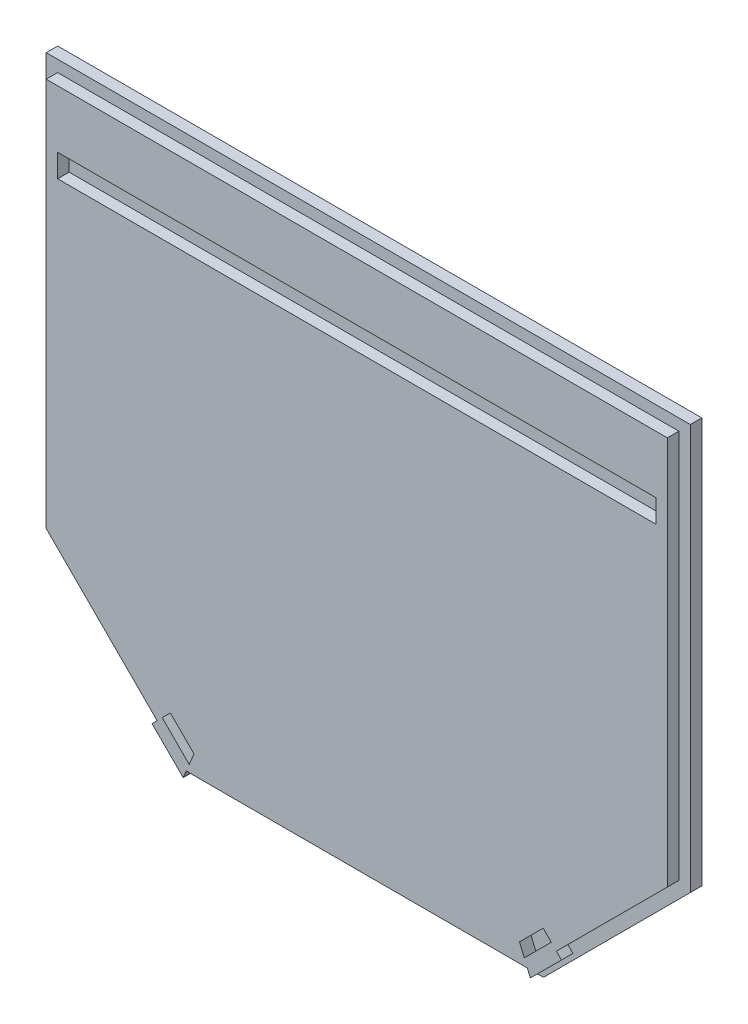
ISO-10303-21;
HEADER;
FILE_DESCRIPTION(('STEP AP214'),'2;1');
FILE_NAME('part.step','',(''),(''),'','','');
FILE_SCHEMA(('AUTOMOTIVE_DESIGN { 1 0 10303 214 1 1 1 1 }'));
ENDSEC;
DATA;
#1=APPLICATION_CONTEXT('core data for automotive mechanical design processes');
#2=APPLICATION_PROTOCOL_DEFINITION('international standard','automotive_design',2000,#1);
#3=PRODUCT_CONTEXT('',#1,'mechanical');
#4=PRODUCT('Part','Part','',(#3));
#5=PRODUCT_RELATED_PRODUCT_CATEGORY('part','',(#4));
#6=PRODUCT_DEFINITION_FORMATION('','',#4);
#7=PRODUCT_DEFINITION_CONTEXT('part definition',#1,'design');
#8=PRODUCT_DEFINITION('design','',#6,#7);
#9=PRODUCT_DEFINITION_SHAPE('','',#8);
#10=(LENGTH_UNIT() NAMED_UNIT(*) SI_UNIT(.MILLI.,.METRE.));
#11=(NAMED_UNIT(*) PLANE_ANGLE_UNIT() SI_UNIT($,.RADIAN.));
#12=(NAMED_UNIT(*) SI_UNIT($,.STERADIAN.) SOLID_ANGLE_UNIT());
#13=UNCERTAINTY_MEASURE_WITH_UNIT(LENGTH_MEASURE(1.E-05),#10,'distance_accuracy_value','');
#14=(GEOMETRIC_REPRESENTATION_CONTEXT(3) GLOBAL_UNCERTAINTY_ASSIGNED_CONTEXT((#13)) GLOBAL_UNIT_ASSIGNED_CONTEXT((#10,
#11,#12)) REPRESENTATION_CONTEXT('',''));
#15=CARTESIAN_POINT('',(0.,0.,0.));
#16=DIRECTION('',(0.,0.,1.));
#17=DIRECTION('',(1.,0.,0.));
#18=AXIS2_PLACEMENT_3D('',#15,#16,#17);
#19=CARTESIAN_POINT('',(0.,0.,12.7));
#20=DIRECTION('',(1.,0.,0.));
#21=DIRECTION('',(0.,1.,0.));
#22=AXIS2_PLACEMENT_3D('',#19,#20,#21);
#23=PLANE('',#22);
#24=DIRECTION('',(0.,-1.,0.));
#25=VECTOR('',#24,1.);
#26=CARTESIAN_POINT('',(0.,0.,6.35));
#27=LINE('',#26,#25);
#28=CARTESIAN_POINT('',(0.,0.,6.35));
#29=VERTEX_POINT('',#28);
#30=CARTESIAN_POINT('',(0.,-223.774000000001,6.35));
#31=VERTEX_POINT('',#30);
#32=EDGE_CURVE('E359',#29,#31,#27,.T.);
#33=ORIENTED_EDGE('',*,*,#32,.F.);
#34=DIRECTION('',(0.,0.,-1.));
#35=VECTOR('',#34,1.);
#36=CARTESIAN_POINT('',(0.,0.,12.7));
#37=LINE('',#36,#35);
#38=CARTESIAN_POINT('',(0.,0.,0.));
#39=VERTEX_POINT('',#38);
#40=EDGE_CURVE('E478',#29,#39,#37,.T.);
#41=ORIENTED_EDGE('',*,*,#40,.T.);
#42=DIRECTION('',(0.,-1.,0.));
#43=VECTOR('',#42,1.);
#44=CARTESIAN_POINT('',(0.,0.,0.));
#45=LINE('',#44,#43);
#46=CARTESIAN_POINT('',(0.,-223.774000000001,0.));
#47=VERTEX_POINT('',#46);
#48=EDGE_CURVE('E454',#39,#47,#45,.T.);
#49=ORIENTED_EDGE('',*,*,#48,.T.);
#50=DIRECTION('',(0.,0.,-1.));
#51=VECTOR('',#50,1.);
#52=CARTESIAN_POINT('',(0.,-223.774000000001,12.7));
#53=LINE('',#52,#51);
#54=EDGE_CURVE('E12',#31,#47,#53,.T.);
#55=ORIENTED_EDGE('',*,*,#54,.F.);
#56=EDGE_LOOP('',(#33,#41,#49,#55));
#57=FACE_BOUND('',#56,.T.);
#58=ADVANCED_FACE('F64',(#57),#23,.F.);
#59=CARTESIAN_POINT('',(81.026,-304.8,12.7));
#60=DIRECTION('',(0.707106781186543,0.707106781186552,0.));
#61=DIRECTION('',(-0.707106781186552,0.707106781186543,0.));
#62=AXIS2_PLACEMENT_3D('',#59,#60,#61);
#63=PLANE('',#62);
#64=DIRECTION('',(0.707106781186551,-0.707106781186544,0.));
#65=VECTOR('',#64,1.);
#66=CARTESIAN_POINT('',(-111.887,-111.887000000002,6.35));
#67=LINE('',#66,#65);
#68=CARTESIAN_POINT('',(81.026,-304.8,6.35));
#69=VERTEX_POINT('',#68);
#70=EDGE_CURVE('E361',#31,#69,#67,.T.);
#71=ORIENTED_EDGE('',*,*,#70,.F.);
#72=ORIENTED_EDGE('',*,*,#54,.T.);
#73=DIRECTION('',(0.707106781186552,-0.707106781186543,0.));
#74=VECTOR('',#73,1.);
#75=CARTESIAN_POINT('',(81.026,-304.8,0.));
#76=LINE('',#75,#74);
#77=CARTESIAN_POINT('',(81.026,-304.8,0.));
#78=VERTEX_POINT('',#77);
#79=EDGE_CURVE('E463',#47,#78,#76,.T.);
#80=ORIENTED_EDGE('',*,*,#79,.T.);
#81=DIRECTION('',(0.,0.,-1.));
#82=VECTOR('',#81,1.);
#83=CARTESIAN_POINT('',(81.026,-304.8,12.7));
#84=LINE('',#83,#82);
#85=EDGE_CURVE('E71',#69,#78,#84,.T.);
#86=ORIENTED_EDGE('',*,*,#85,.F.);
#87=EDGE_LOOP('',(#71,#72,#80,#86));
#88=FACE_BOUND('',#87,.T.);
#89=ADVANCED_FACE('F494',(#88),#63,.F.);
#90=CARTESIAN_POINT('',(81.026,-304.8,12.7));
#91=DIRECTION('',(0.,1.,0.));
#92=DIRECTION('',(0.,0.,1.));
#93=AXIS2_PLACEMENT_3D('',#90,#91,#92);
#94=PLANE('',#93);
#95=DIRECTION('',(1.,0.,0.));
#96=VECTOR('',#95,1.);
#97=CARTESIAN_POINT('',(0.,-304.8,6.35));
#98=LINE('',#97,#96);
#99=CARTESIAN_POINT('',(274.574,-304.8,6.35));
#100=VERTEX_POINT('',#99);
#101=EDGE_CURVE('E363',#69,#100,#98,.T.);
#102=ORIENTED_EDGE('',*,*,#101,.F.);
#103=ORIENTED_EDGE('',*,*,#85,.T.);
#104=DIRECTION('',(1.,0.,0.));
#105=VECTOR('',#104,1.);
#106=CARTESIAN_POINT('',(81.026,-304.8,0.));
#107=LINE('',#106,#105);
#108=CARTESIAN_POINT('',(274.574,-304.8,0.));
#109=VERTEX_POINT('',#108);
#110=EDGE_CURVE('E466',#78,#109,#107,.T.);
#111=ORIENTED_EDGE('',*,*,#110,.T.);
#112=DIRECTION('',(0.,0.,-1.));
#113=VECTOR('',#112,1.);
#114=CARTESIAN_POINT('',(274.574,-304.8,12.7));
#115=LINE('',#114,#113);
#116=EDGE_CURVE('E484',#100,#109,#115,.T.);
#117=ORIENTED_EDGE('',*,*,#116,.F.);
#118=EDGE_LOOP('',(#102,#103,#111,#117));
#119=FACE_BOUND('',#118,.T.);
#120=ADVANCED_FACE('F488',(#119),#94,.F.);
#121=CARTESIAN_POINT('',(292.534512242138,-286.839487757862,12.7));
#122=DIRECTION('',(-0.707106781186544,0.707106781186551,0.));
#123=DIRECTION('',(-0.707106781186551,-0.707106781186544,0.));
#124=AXIS2_PLACEMENT_3D('',#121,#122,#123);
#125=PLANE('',#124);
#126=DIRECTION('',(0.707106781186552,0.707106781186543,0.));
#127=VECTOR('',#126,1.);
#128=CARTESIAN_POINT('',(289.686999999998,-289.687000000002,6.35));
#129=LINE('',#128,#127);
#130=CARTESIAN_POINT('',(355.6,-223.774000000001,6.35));
#131=VERTEX_POINT('',#130);
#132=EDGE_CURVE('E365',#100,#131,#129,.T.);
#133=ORIENTED_EDGE('',*,*,#132,.F.);
#134=ORIENTED_EDGE('',*,*,#116,.T.);
#135=DIRECTION('',(0.707106781186551,0.707106781186544,0.));
#136=VECTOR('',#135,1.);
#137=CARTESIAN_POINT('',(292.534512242138,-286.839487757862,0.));
#138=LINE('',#137,#136);
#139=CARTESIAN_POINT('',(355.6,-223.774000000001,0.));
#140=VERTEX_POINT('',#139);
#141=EDGE_CURVE('E469',#109,#140,#138,.T.);
#142=ORIENTED_EDGE('',*,*,#141,.T.);
#143=DIRECTION('',(0.,0.,-1.));
#144=VECTOR('',#143,1.);
#145=CARTESIAN_POINT('',(355.6,-223.774000000001,12.7));
#146=LINE('',#145,#144);
#147=EDGE_CURVE('E482',#131,#140,#146,.T.);
#148=ORIENTED_EDGE('',*,*,#147,.F.);
#149=EDGE_LOOP('',(#133,#134,#142,#148));
#150=FACE_BOUND('',#149,.T.);
#151=ADVANCED_FACE('F505',(#150),#125,.F.);
#152=CARTESIAN_POINT('',(355.6,-223.774000000001,12.7));
#153=DIRECTION('',(-1.,0.,0.));
#154=DIRECTION('',(0.,0.,1.));
#155=AXIS2_PLACEMENT_3D('',#152,#153,#154);
#156=PLANE('',#155);
#157=DIRECTION('',(0.,1.,0.));
#158=VECTOR('',#157,1.);
#159=CARTESIAN_POINT('',(355.6,0.,6.35));
#160=LINE('',#159,#158);
#161=CARTESIAN_POINT('',(355.6,0.,6.35));
#162=VERTEX_POINT('',#161);
#163=EDGE_CURVE('E367',#131,#162,#160,.T.);
#164=ORIENTED_EDGE('',*,*,#163,.F.);
#165=ORIENTED_EDGE('',*,*,#147,.T.);
#166=DIRECTION('',(0.,1.,0.));
#167=VECTOR('',#166,1.);
#168=CARTESIAN_POINT('',(355.6,-223.774000000001,0.));
#169=LINE('',#168,#167);
#170=CARTESIAN_POINT('',(355.6,0.,0.));
#171=VERTEX_POINT('',#170);
#172=EDGE_CURVE('E472',#140,#171,#169,.T.);
#173=ORIENTED_EDGE('',*,*,#172,.T.);
#174=DIRECTION('',(0.,0.,-1.));
#175=VECTOR('',#174,1.);
#176=CARTESIAN_POINT('',(355.6,0.,12.7));
#177=LINE('',#176,#175);
#178=EDGE_CURVE('E480',#162,#171,#177,.T.);
#179=ORIENTED_EDGE('',*,*,#178,.F.);
#180=EDGE_LOOP('',(#164,#165,#173,#179));
#181=FACE_BOUND('',#180,.T.);
#182=ADVANCED_FACE('F512',(#181),#156,.F.);
#183=CARTESIAN_POINT('',(0.,0.,12.7));
#184=DIRECTION('',(0.,-1.,0.));
#185=DIRECTION('',(0.,0.,-1.));
#186=AXIS2_PLACEMENT_3D('',#183,#184,#185);
#187=PLANE('',#186);
#188=DIRECTION('',(-1.,0.,0.));
#189=VECTOR('',#188,1.);
#190=CARTESIAN_POINT('',(0.,0.,6.35));
#191=LINE('',#190,#189);
#192=EDGE_CURVE('E357',#162,#29,#191,.T.);
#193=ORIENTED_EDGE('',*,*,#192,.F.);
#194=ORIENTED_EDGE('',*,*,#178,.T.);
#195=DIRECTION('',(-1.,0.,0.));
#196=VECTOR('',#195,1.);
#197=CARTESIAN_POINT('',(0.,0.,0.));
#198=LINE('',#197,#196);
#199=EDGE_CURVE('E475',#171,#39,#198,.T.);
#200=ORIENTED_EDGE('',*,*,#199,.T.);
#201=ORIENTED_EDGE('',*,*,#40,.F.);
#202=EDGE_LOOP('',(#193,#194,#200,#201));
#203=FACE_BOUND('',#202,.T.);
#204=ADVANCED_FACE('F514',(#203),#187,.F.);
#205=CARTESIAN_POINT('',(0.,0.,0.));
#206=DIRECTION('',(0.,0.,1.));
#207=DIRECTION('',(1.,0.,0.));
#208=AXIS2_PLACEMENT_3D('',#205,#206,#207);
#209=PLANE('',#208);
#210=ORIENTED_EDGE('',*,*,#48,.F.);
#211=ORIENTED_EDGE('',*,*,#199,.F.);
#212=ORIENTED_EDGE('',*,*,#172,.F.);
#213=ORIENTED_EDGE('',*,*,#141,.F.);
#214=ORIENTED_EDGE('',*,*,#110,.F.);
#215=ORIENTED_EDGE('',*,*,#79,.F.);
#216=EDGE_LOOP('',(#210,#211,#212,#213,#214,#215));
#217=FACE_BOUND('',#216,.T.);
#218=ADVANCED_FACE('F499',(#217),#209,.F.);
#219=CARTESIAN_POINT('',(2.79565736456703,2.79565736456703,6.35));
#220=DIRECTION('',(0.707106781186548,0.707106781186548,0.));
#221=DIRECTION('',(-0.707106781186548,0.707106781186548,0.));
#222=AXIS2_PLACEMENT_3D('',#219,#220,#221);
#223=PLANE('',#222);
#224=DIRECTION('',(-0.707106781186548,0.707106781186548,0.));
#225=VECTOR('',#224,1.);
#226=CARTESIAN_POINT('',(2.79565736456703,2.79565736456703,12.7));
#227=LINE('',#226,#225);
#228=CARTESIAN_POINT('',(290.812329726048,-285.221014996914,12.7));
#229=VERTEX_POINT('',#228);
#230=CARTESIAN_POINT('',(287.992529304033,-282.401214574899,12.7));
#231=VERTEX_POINT('',#230);
#232=EDGE_CURVE('E295',#229,#231,#227,.T.);
#233=ORIENTED_EDGE('',*,*,#232,.F.);
#234=DIRECTION('',(0.,0.,1.));
#235=VECTOR('',#234,1.);
#236=CARTESIAN_POINT('',(290.812329726048,-285.221014996914,6.35));
#237=LINE('',#236,#235);
#238=CARTESIAN_POINT('',(290.812329726048,-285.221014996914,6.35));
#239=VERTEX_POINT('',#238);
#240=EDGE_CURVE('E369',#239,#229,#237,.T.);
#241=ORIENTED_EDGE('',*,*,#240,.F.);
#242=DIRECTION('',(-0.707106781186548,0.707106781186548,0.));
#243=VECTOR('',#242,1.);
#244=CARTESIAN_POINT('',(2.79565736456703,2.79565736456703,6.35));
#245=LINE('',#244,#243);
#246=CARTESIAN_POINT('',(287.992529304033,-282.401214574899,6.35));
#247=VERTEX_POINT('',#246);
#248=EDGE_CURVE('E328',#239,#247,#245,.T.);
#249=ORIENTED_EDGE('',*,*,#248,.T.);
#250=DIRECTION('',(0.,0.,1.));
#251=VECTOR('',#250,1.);
#252=CARTESIAN_POINT('',(287.992529304033,-282.401214574899,6.35));
#253=LINE('',#252,#251);
#254=EDGE_CURVE('E404',#247,#231,#253,.T.);
#255=ORIENTED_EDGE('',*,*,#254,.T.);
#256=EDGE_LOOP('',(#233,#241,#249,#255));
#257=FACE_BOUND('',#256,.T.);
#258=ADVANCED_FACE('F536',(#257),#223,.T.);
#259=CARTESIAN_POINT('',(285.196871939467,-285.196871939465,6.35));
#260=DIRECTION('',(0.70710678118655,-0.707106781186545,0.));
#261=DIRECTION('',(0.707106781186545,0.70710678118655,0.));
#262=AXIS2_PLACEMENT_3D('',#259,#260,#261);
#263=PLANE('',#262);
#264=DIRECTION('',(0.707106781186545,0.70710678118655,0.));
#265=VECTOR('',#264,1.);
#266=CARTESIAN_POINT('',(285.196871939467,-285.196871939465,12.7));
#267=LINE('',#266,#265);
#268=CARTESIAN_POINT('',(349.25,-221.143743878931,12.7));
#269=VERTEX_POINT('',#268);
#270=EDGE_CURVE('E332',#231,#269,#267,.T.);
#271=ORIENTED_EDGE('',*,*,#270,.F.);
#272=ORIENTED_EDGE('',*,*,#254,.F.);
#273=DIRECTION('',(0.707106781186545,0.70710678118655,0.));
#274=VECTOR('',#273,1.);
#275=CARTESIAN_POINT('',(285.196871939467,-285.196871939465,6.35));
#276=LINE('',#275,#274);
#277=CARTESIAN_POINT('',(349.25,-221.143743878931,6.35));
#278=VERTEX_POINT('',#277);
#279=EDGE_CURVE('E355',#247,#278,#276,.T.);
#280=ORIENTED_EDGE('',*,*,#279,.T.);
#281=DIRECTION('',(0.,0.,1.));
#282=VECTOR('',#281,1.);
#283=CARTESIAN_POINT('',(349.25,-221.143743878931,6.35));
#284=LINE('',#283,#282);
#285=EDGE_CURVE('E408',#278,#269,#284,.T.);
#286=ORIENTED_EDGE('',*,*,#285,.T.);
#287=EDGE_LOOP('',(#271,#272,#280,#286));
#288=FACE_BOUND('',#287,.T.);
#289=ADVANCED_FACE('F564',(#288),#263,.T.);
#290=CARTESIAN_POINT('',(349.25,0.,6.35));
#291=DIRECTION('',(1.,0.,0.));
#292=DIRECTION('',(0.,0.,-1.));
#293=AXIS2_PLACEMENT_3D('',#290,#291,#292);
#294=PLANE('',#293);
#295=DIRECTION('',(0.,1.,0.));
#296=VECTOR('',#295,1.);
#297=CARTESIAN_POINT('',(349.25,0.,12.7));
#298=LINE('',#297,#296);
#299=CARTESIAN_POINT('',(349.25,-6.35,12.7));
#300=VERTEX_POINT('',#299);
#301=EDGE_CURVE('E399',#269,#300,#298,.T.);
#302=ORIENTED_EDGE('',*,*,#301,.F.);
#303=ORIENTED_EDGE('',*,*,#285,.F.);
#304=DIRECTION('',(0.,1.,0.));
#305=VECTOR('',#304,1.);
#306=CARTESIAN_POINT('',(349.25,0.,6.35));
#307=LINE('',#306,#305);
#308=CARTESIAN_POINT('',(349.25,-6.35,6.35));
#309=VERTEX_POINT('',#308);
#310=EDGE_CURVE('E353',#278,#309,#307,.T.);
#311=ORIENTED_EDGE('',*,*,#310,.T.);
#312=DIRECTION('',(0.,0.,1.));
#313=VECTOR('',#312,1.);
#314=CARTESIAN_POINT('',(349.25,-6.35,6.35));
#315=LINE('',#314,#313);
#316=EDGE_CURVE('E410',#309,#300,#315,.T.);
#317=ORIENTED_EDGE('',*,*,#316,.T.);
#318=EDGE_LOOP('',(#302,#303,#311,#317));
#319=FACE_BOUND('',#318,.T.);
#320=ADVANCED_FACE('F601',(#319),#294,.T.);
#321=CARTESIAN_POINT('',(0.,-6.35000000000004,6.35));
#322=DIRECTION('',(0.,1.,0.));
#323=DIRECTION('',(-1.,0.,0.));
#324=AXIS2_PLACEMENT_3D('',#321,#322,#323);
#325=PLANE('',#324);
#326=DIRECTION('',(-1.,0.,0.));
#327=VECTOR('',#326,1.);
#328=CARTESIAN_POINT('',(0.,-6.35000000000004,12.7));
#329=LINE('',#328,#327);
#330=CARTESIAN_POINT('',(6.35000000000002,-6.35000000000004,12.7));
#331=VERTEX_POINT('',#330);
#332=EDGE_CURVE('E396',#300,#331,#329,.T.);
#333=ORIENTED_EDGE('',*,*,#332,.F.);
#334=ORIENTED_EDGE('',*,*,#316,.F.);
#335=DIRECTION('',(-1.,0.,0.));
#336=VECTOR('',#335,1.);
#337=CARTESIAN_POINT('',(0.,-6.35000000000004,6.35));
#338=LINE('',#337,#336);
#339=CARTESIAN_POINT('',(6.35000000000002,-6.35000000000004,6.35));
#340=VERTEX_POINT('',#339);
#341=EDGE_CURVE('E351',#309,#340,#338,.T.);
#342=ORIENTED_EDGE('',*,*,#341,.T.);
#343=DIRECTION('',(0.,0.,1.));
#344=VECTOR('',#343,1.);
#345=CARTESIAN_POINT('',(6.35000000000002,-6.35000000000004,6.35));
#346=LINE('',#345,#344);
#347=EDGE_CURVE('E412',#340,#331,#346,.T.);
#348=ORIENTED_EDGE('',*,*,#347,.T.);
#349=EDGE_LOOP('',(#333,#334,#342,#348));
#350=FACE_BOUND('',#349,.T.);
#351=ADVANCED_FACE('F597',(#350),#325,.T.);
#352=CARTESIAN_POINT('',(6.35000000000002,0.,6.35));
#353=DIRECTION('',(-1.,0.,0.));
#354=DIRECTION('',(0.,-1.,0.));
#355=AXIS2_PLACEMENT_3D('',#352,#353,#354);
#356=PLANE('',#355);
#357=DIRECTION('',(0.,-1.,0.));
#358=VECTOR('',#357,1.);
#359=CARTESIAN_POINT('',(6.35000000000002,0.,12.7));
#360=LINE('',#359,#358);
#361=CARTESIAN_POINT('',(6.35000000000002,-221.143743878932,12.7));
#362=VERTEX_POINT('',#361);
#363=EDGE_CURVE('E393',#331,#362,#360,.T.);
#364=ORIENTED_EDGE('',*,*,#363,.F.);
#365=ORIENTED_EDGE('',*,*,#347,.F.);
#366=DIRECTION('',(0.,-1.,0.));
#367=VECTOR('',#366,1.);
#368=CARTESIAN_POINT('',(6.35000000000002,0.,6.35));
#369=LINE('',#368,#367);
#370=CARTESIAN_POINT('',(6.35000000000002,-221.143743878932,6.35));
#371=VERTEX_POINT('',#370);
#372=EDGE_CURVE('E349',#340,#371,#369,.T.);
#373=ORIENTED_EDGE('',*,*,#372,.T.);
#374=DIRECTION('',(0.,0.,1.));
#375=VECTOR('',#374,1.);
#376=CARTESIAN_POINT('',(6.35000000000002,-221.143743878932,6.35));
#377=LINE('',#376,#375);
#378=EDGE_CURVE('E414',#371,#362,#377,.T.);
#379=ORIENTED_EDGE('',*,*,#378,.T.);
#380=EDGE_LOOP('',(#364,#365,#373,#379));
#381=FACE_BOUND('',#380,.T.);
#382=ADVANCED_FACE('F593',(#381),#356,.T.);
#383=CARTESIAN_POINT('',(-107.396871939466,-107.396871939466,6.35));
#384=DIRECTION('',(-0.707106781186548,-0.707106781186547,0.));
#385=DIRECTION('',(0.707106781186547,-0.707106781186548,0.));
#386=AXIS2_PLACEMENT_3D('',#383,#384,#385);
#387=PLANE('',#386);
#388=DIRECTION('',(0.707106781186547,-0.707106781186548,0.));
#389=VECTOR('',#388,1.);
#390=CARTESIAN_POINT('',(-107.396871939466,-107.396871939466,12.7));
#391=LINE('',#390,#389);
#392=CARTESIAN_POINT('',(67.6074706959665,-282.401214574898,12.7));
#393=VERTEX_POINT('',#392);
#394=EDGE_CURVE('E390',#362,#393,#391,.T.);
#395=ORIENTED_EDGE('',*,*,#394,.F.);
#396=ORIENTED_EDGE('',*,*,#378,.F.);
#397=DIRECTION('',(0.707106781186547,-0.707106781186548,0.));
#398=VECTOR('',#397,1.);
#399=CARTESIAN_POINT('',(-107.396871939466,-107.396871939466,6.35));
#400=LINE('',#399,#398);
#401=CARTESIAN_POINT('',(67.6074706959665,-282.401214574898,6.35));
#402=VERTEX_POINT('',#401);
#403=EDGE_CURVE('E347',#371,#402,#400,.T.);
#404=ORIENTED_EDGE('',*,*,#403,.T.);
#405=DIRECTION('',(0.,0.,1.));
#406=VECTOR('',#405,1.);
#407=CARTESIAN_POINT('',(67.6074706959665,-282.401214574898,6.35));
#408=LINE('',#407,#406);
#409=EDGE_CURVE('E416',#402,#393,#408,.T.);
#410=ORIENTED_EDGE('',*,*,#409,.T.);
#411=EDGE_LOOP('',(#395,#396,#404,#410));
#412=FACE_BOUND('',#411,.T.);
#413=ADVANCED_FACE('F589',(#412),#387,.T.);
#414=CARTESIAN_POINT('',(175.004342635432,-175.004342635433,6.35));
#415=DIRECTION('',(0.707106781186546,-0.707106781186549,0.));
#416=DIRECTION('',(0.707106781186549,0.707106781186546,0.));
#417=AXIS2_PLACEMENT_3D('',#414,#415,#416);
#418=PLANE('',#417);
#419=DIRECTION('',(0.707106781186549,0.707106781186546,0.));
#420=VECTOR('',#419,1.);
#421=CARTESIAN_POINT('',(175.004342635432,-175.004342635433,12.7));
#422=LINE('',#421,#420);
#423=CARTESIAN_POINT('',(64.7876702739508,-285.221014996914,12.7));
#424=VERTEX_POINT('',#423);
#425=EDGE_CURVE('E387',#424,#393,#422,.T.);
#426=ORIENTED_EDGE('',*,*,#425,.T.);
#427=ORIENTED_EDGE('',*,*,#409,.F.);
#428=DIRECTION('',(0.707106781186549,0.707106781186546,0.));
#429=VECTOR('',#428,1.);
#430=CARTESIAN_POINT('',(175.004342635432,-175.004342635433,6.35));
#431=LINE('',#430,#429);
#432=CARTESIAN_POINT('',(64.7876702739508,-285.221014996914,6.35));
#433=VERTEX_POINT('',#432);
#434=EDGE_CURVE('E344',#433,#402,#431,.T.);
#435=ORIENTED_EDGE('',*,*,#434,.F.);
#436=DIRECTION('',(0.,0.,1.));
#437=VECTOR('',#436,1.);
#438=CARTESIAN_POINT('',(64.7876702739508,-285.221014996914,6.35));
#439=LINE('',#438,#437);
#440=EDGE_CURVE('E418',#433,#424,#439,.T.);
#441=ORIENTED_EDGE('',*,*,#440,.T.);
#442=EDGE_LOOP('',(#426,#427,#435,#441));
#443=FACE_BOUND('',#442,.T.);
#444=ADVANCED_FACE('F585',(#443),#418,.F.);
#445=CARTESIAN_POINT('',(-110.216672361482,-110.216672361482,6.35));
#446=DIRECTION('',(-0.707106781186547,-0.707106781186548,0.));
#447=DIRECTION('',(0.707106781186548,-0.707106781186547,0.));
#448=AXIS2_PLACEMENT_3D('',#445,#446,#447);
#449=PLANE('',#448);
#450=DIRECTION('',(0.707106781186548,-0.707106781186547,0.));
#451=VECTOR('',#450,1.);
#452=CARTESIAN_POINT('',(-110.216672361482,-110.216672361482,12.7));
#453=LINE('',#452,#451);
#454=CARTESIAN_POINT('',(82.0044552770368,-302.4378,12.7));
#455=VERTEX_POINT('',#454);
#456=EDGE_CURVE('E384',#424,#455,#453,.T.);
#457=ORIENTED_EDGE('',*,*,#456,.F.);
#458=ORIENTED_EDGE('',*,*,#440,.F.);
#459=DIRECTION('',(0.707106781186548,-0.707106781186547,0.));
#460=VECTOR('',#459,1.);
#461=CARTESIAN_POINT('',(-110.216672361482,-110.216672361482,6.35));
#462=LINE('',#461,#460);
#463=CARTESIAN_POINT('',(82.0044552770368,-302.4378,6.35));
#464=VERTEX_POINT('',#463);
#465=EDGE_CURVE('E342',#433,#464,#462,.T.);
#466=ORIENTED_EDGE('',*,*,#465,.T.);
#467=DIRECTION('',(0.,0.,1.));
#468=VECTOR('',#467,1.);
#469=CARTESIAN_POINT('',(82.0044552770368,-302.4378,6.35));
#470=LINE('',#469,#468);
#471=EDGE_CURVE('E420',#464,#455,#470,.T.);
#472=ORIENTED_EDGE('',*,*,#471,.T.);
#473=EDGE_LOOP('',(#457,#458,#466,#472));
#474=FACE_BOUND('',#473,.T.);
#475=ADVANCED_FACE('F581',(#474),#449,.T.);
#476=CARTESIAN_POINT('',(176.923090479039,-73.2839435733788,6.35));
#477=DIRECTION('',(0.923879532511289,-0.382683432365084,0.));
#478=DIRECTION('',(0.382683432365084,0.923879532511289,0.));
#479=AXIS2_PLACEMENT_3D('',#476,#477,#478);
#480=PLANE('',#479);
#481=DIRECTION('',(0.382683432365084,0.923879532511289,0.));
#482=VECTOR('',#481,1.);
#483=CARTESIAN_POINT('',(176.923090479039,-73.2839435733788,12.7));
#484=LINE('',#483,#482);
#485=CARTESIAN_POINT('',(83.6562561210682,-298.45,12.7));
#486=VERTEX_POINT('',#485);
#487=EDGE_CURVE('E381',#455,#486,#484,.T.);
#488=ORIENTED_EDGE('',*,*,#487,.F.);
#489=ORIENTED_EDGE('',*,*,#471,.F.);
#490=DIRECTION('',(0.382683432365084,0.923879532511289,0.));
#491=VECTOR('',#490,1.);
#492=CARTESIAN_POINT('',(176.923090479039,-73.2839435733788,6.35));
#493=LINE('',#492,#491);
#494=CARTESIAN_POINT('',(83.6562561210682,-298.45,6.35));
#495=VERTEX_POINT('',#494);
#496=EDGE_CURVE('E340',#464,#495,#493,.T.);
#497=ORIENTED_EDGE('',*,*,#496,.T.);
#498=DIRECTION('',(0.,0.,1.));
#499=VECTOR('',#498,1.);
#500=CARTESIAN_POINT('',(83.6562561210682,-298.45,6.35));
#501=LINE('',#500,#499);
#502=EDGE_CURVE('E422',#495,#486,#501,.T.);
#503=ORIENTED_EDGE('',*,*,#502,.T.);
#504=EDGE_LOOP('',(#488,#489,#497,#503));
#505=FACE_BOUND('',#504,.T.);
#506=ADVANCED_FACE('F577',(#505),#480,.T.);
#507=CARTESIAN_POINT('',(0.,-298.45,6.35));
#508=DIRECTION('',(0.,-1.,0.));
#509=DIRECTION('',(0.,0.,-1.));
#510=AXIS2_PLACEMENT_3D('',#507,#508,#509);
#511=PLANE('',#510);
#512=DIRECTION('',(1.,0.,0.));
#513=VECTOR('',#512,1.);
#514=CARTESIAN_POINT('',(0.,-298.45,12.7));
#515=LINE('',#514,#513);
#516=CARTESIAN_POINT('',(271.943743878931,-298.45,12.7));
#517=VERTEX_POINT('',#516);
#518=EDGE_CURVE('E378',#486,#517,#515,.T.);
#519=ORIENTED_EDGE('',*,*,#518,.F.);
#520=ORIENTED_EDGE('',*,*,#502,.F.);
#521=DIRECTION('',(1.,0.,0.));
#522=VECTOR('',#521,1.);
#523=CARTESIAN_POINT('',(0.,-298.45,6.35));
#524=LINE('',#523,#522);
#525=CARTESIAN_POINT('',(271.943743878931,-298.45,6.35));
#526=VERTEX_POINT('',#525);
#527=EDGE_CURVE('E338',#495,#526,#524,.T.);
#528=ORIENTED_EDGE('',*,*,#527,.T.);
#529=DIRECTION('',(0.,0.,1.));
#530=VECTOR('',#529,1.);
#531=CARTESIAN_POINT('',(271.943743878931,-298.45,6.35));
#532=LINE('',#531,#530);
#533=EDGE_CURVE('E424',#526,#517,#532,.T.);
#534=ORIENTED_EDGE('',*,*,#533,.T.);
#535=EDGE_LOOP('',(#519,#520,#528,#534));
#536=FACE_BOUND('',#535,.T.);
#537=ADVANCED_FACE('F573',(#536),#511,.T.);
#538=CARTESIAN_POINT('',(126.600495215941,52.4396421215881,6.35));
#539=DIRECTION('',(0.9238795325113,0.382683432365059,0.));
#540=DIRECTION('',(-0.382683432365059,0.9238795325113,0.));
#541=AXIS2_PLACEMENT_3D('',#538,#539,#540);
#542=PLANE('',#541);
#543=DIRECTION('',(-0.382683432365059,0.9238795325113,0.));
#544=VECTOR('',#543,1.);
#545=CARTESIAN_POINT('',(126.600495215941,52.4396421215881,12.7));
#546=LINE('',#545,#544);
#547=CARTESIAN_POINT('',(273.595544722962,-302.4378,12.7));
#548=VERTEX_POINT('',#547);
#549=EDGE_CURVE('E375',#548,#517,#546,.T.);
#550=ORIENTED_EDGE('',*,*,#549,.T.);
#551=ORIENTED_EDGE('',*,*,#533,.F.);
#552=DIRECTION('',(-0.382683432365059,0.9238795325113,0.));
#553=VECTOR('',#552,1.);
#554=CARTESIAN_POINT('',(126.600495215941,52.4396421215881,6.35));
#555=LINE('',#554,#553);
#556=CARTESIAN_POINT('',(273.595544722962,-302.4378,6.35));
#557=VERTEX_POINT('',#556);
#558=EDGE_CURVE('E335',#557,#526,#555,.T.);
#559=ORIENTED_EDGE('',*,*,#558,.F.);
#560=DIRECTION('',(0.,0.,1.));
#561=VECTOR('',#560,1.);
#562=CARTESIAN_POINT('',(273.595544722962,-302.4378,6.35));
#563=LINE('',#562,#561);
#564=EDGE_CURVE('E426',#557,#548,#563,.T.);
#565=ORIENTED_EDGE('',*,*,#564,.T.);
#566=EDGE_LOOP('',(#550,#551,#559,#565));
#567=FACE_BOUND('',#566,.T.);
#568=ADVANCED_FACE('F569',(#567),#542,.F.);
#569=CARTESIAN_POINT('',(288.01667236148,-288.016672361482,6.35));
#570=DIRECTION('',(-0.707106781186545,0.70710678118655,0.));
#571=DIRECTION('',(-0.70710678118655,-0.707106781186545,0.));
#572=AXIS2_PLACEMENT_3D('',#569,#570,#571);
#573=PLANE('',#572);
#574=DIRECTION('',(-0.70710678118655,-0.707106781186545,0.));
#575=VECTOR('',#574,1.);
#576=CARTESIAN_POINT('',(288.01667236148,-288.016672361482,12.7));
#577=LINE('',#576,#575);
#578=EDGE_CURVE('E372',#229,#548,#577,.T.);
#579=ORIENTED_EDGE('',*,*,#578,.T.);
#580=ORIENTED_EDGE('',*,*,#564,.F.);
#581=DIRECTION('',(-0.70710678118655,-0.707106781186545,0.));
#582=VECTOR('',#581,1.);
#583=CARTESIAN_POINT('',(288.01667236148,-288.016672361482,6.35));
#584=LINE('',#583,#582);
#585=EDGE_CURVE('E331',#239,#557,#584,.T.);
#586=ORIENTED_EDGE('',*,*,#585,.F.);
#587=ORIENTED_EDGE('',*,*,#240,.T.);
#588=EDGE_LOOP('',(#579,#580,#586,#587));
#589=FACE_BOUND('',#588,.T.);
#590=ADVANCED_FACE('F566',(#589),#573,.F.);
#591=CARTESIAN_POINT('',(0.,0.,6.35));
#592=DIRECTION('',(0.,0.,1.));
#593=DIRECTION('',(1.,0.,0.));
#594=AXIS2_PLACEMENT_3D('',#591,#592,#593);
#595=PLANE('',#594);
#596=ORIENTED_EDGE('',*,*,#248,.F.);
#597=ORIENTED_EDGE('',*,*,#585,.T.);
#598=ORIENTED_EDGE('',*,*,#558,.T.);
#599=ORIENTED_EDGE('',*,*,#527,.F.);
#600=ORIENTED_EDGE('',*,*,#496,.F.);
#601=ORIENTED_EDGE('',*,*,#465,.F.);
#602=ORIENTED_EDGE('',*,*,#434,.T.);
#603=ORIENTED_EDGE('',*,*,#403,.F.);
#604=ORIENTED_EDGE('',*,*,#372,.F.);
#605=ORIENTED_EDGE('',*,*,#341,.F.);
#606=ORIENTED_EDGE('',*,*,#310,.F.);
#607=ORIENTED_EDGE('',*,*,#279,.F.);
#608=EDGE_LOOP('',(#596,#597,#598,#599,#600,#601,#602,#603,#604,#605,#606,#607));
#609=FACE_BOUND('',#608,.T.);
#610=ORIENTED_EDGE('',*,*,#192,.T.);
#611=ORIENTED_EDGE('',*,*,#32,.T.);
#612=ORIENTED_EDGE('',*,*,#70,.T.);
#613=ORIENTED_EDGE('',*,*,#101,.T.);
#614=ORIENTED_EDGE('',*,*,#132,.T.);
#615=ORIENTED_EDGE('',*,*,#163,.T.);
#616=EDGE_LOOP('',(#610,#611,#612,#613,#614,#615));
#617=FACE_BOUND('',#616,.T.);
#618=ADVANCED_FACE('F508',(#609,#617),#595,.T.);
#619=CARTESIAN_POINT('',(0.,0.,12.7));
#620=DIRECTION('',(0.,0.,1.));
#621=DIRECTION('',(1.,0.,0.));
#622=AXIS2_PLACEMENT_3D('',#619,#620,#621);
#623=PLANE('',#622);
#624=DIRECTION('',(0.382683432365092,0.923879532511286,0.));
#625=VECTOR('',#624,1.);
#626=CARTESIAN_POINT('',(85.3080569650992,-294.462199999999,12.7));
#627=LINE('',#626,#625);
#628=CARTESIAN_POINT('',(85.3080569650992,-294.462199999999,12.7));
#629=VERTEX_POINT('',#628);
#630=CARTESIAN_POINT('',(87.9383130861683,-288.1122,12.7));
#631=VERTEX_POINT('',#630);
#632=EDGE_CURVE('E78',#629,#631,#627,.T.);
#633=ORIENTED_EDGE('',*,*,#632,.F.);
#634=DIRECTION('',(0.707106781186547,-0.707106781186548,0.));
#635=VECTOR('',#634,1.);
#636=CARTESIAN_POINT('',(85.3080569650992,-294.462199999999,12.7));
#637=LINE('',#636,#635);
#638=CARTESIAN_POINT('',(70.4008318041244,-279.554974839025,12.7));
#639=VERTEX_POINT('',#638);
#640=EDGE_CURVE('E279',#639,#629,#637,.T.);
#641=ORIENTED_EDGE('',*,*,#640,.F.);
#642=DIRECTION('',(-0.707106781186549,-0.707106781186546,0.));
#643=VECTOR('',#642,1.);
#644=CARTESIAN_POINT('',(70.4008318041244,-279.554974839025,12.7));
#645=LINE('',#644,#643);
#646=CARTESIAN_POINT('',(74.8909598646589,-275.06484677849,12.7));
#647=VERTEX_POINT('',#646);
#648=EDGE_CURVE('E282',#647,#639,#645,.T.);
#649=ORIENTED_EDGE('',*,*,#648,.F.);
#650=DIRECTION('',(-0.707106781186545,0.70710678118655,0.));
#651=VECTOR('',#650,1.);
#652=CARTESIAN_POINT('',(74.8909598646589,-275.06484677849,12.7));
#653=LINE('',#652,#651);
#654=EDGE_CURVE('E288',#631,#647,#653,.T.);
#655=ORIENTED_EDGE('',*,*,#654,.F.);
#656=EDGE_LOOP('',(#633,#641,#649,#655));
#657=FACE_BOUND('',#656,.T.);
#658=DIRECTION('',(0.707106781186548,0.707106781186548,0.));
#659=VECTOR('',#658,1.);
#660=CARTESIAN_POINT('',(270.291943034901,-294.462199999999,12.7));
#661=LINE('',#660,#659);
#662=CARTESIAN_POINT('',(270.291943034901,-294.462199999999,12.7));
#663=VERTEX_POINT('',#662);
#664=CARTESIAN_POINT('',(285.199168195876,-279.554974839025,12.7));
#665=VERTEX_POINT('',#664);
#666=EDGE_CURVE('E86',#663,#665,#661,.T.);
#667=ORIENTED_EDGE('',*,*,#666,.F.);
#668=DIRECTION('',(0.382683432365087,-0.923879532511288,0.));
#669=VECTOR('',#668,1.);
#670=CARTESIAN_POINT('',(270.291943034901,-294.462199999999,12.7));
#671=LINE('',#670,#669);
#672=CARTESIAN_POINT('',(267.661686913832,-288.1122,12.7));
#673=VERTEX_POINT('',#672);
#674=EDGE_CURVE('E303',#673,#663,#671,.T.);
#675=ORIENTED_EDGE('',*,*,#674,.F.);
#676=DIRECTION('',(-0.707106781186544,-0.70710678118655,0.));
#677=VECTOR('',#676,1.);
#678=CARTESIAN_POINT('',(280.709040135341,-275.06484677849,12.7));
#679=LINE('',#678,#677);
#680=CARTESIAN_POINT('',(280.709040135341,-275.06484677849,12.7));
#681=VERTEX_POINT('',#680);
#682=EDGE_CURVE('E317',#681,#673,#679,.T.);
#683=ORIENTED_EDGE('',*,*,#682,.F.);
#684=DIRECTION('',(-0.707106781186547,0.707106781186547,0.));
#685=VECTOR('',#684,1.);
#686=CARTESIAN_POINT('',(285.199168195876,-279.554974839025,12.7));
#687=LINE('',#686,#685);
#688=EDGE_CURVE('E314',#665,#681,#687,.T.);
#689=ORIENTED_EDGE('',*,*,#688,.F.);
#690=EDGE_LOOP('',(#667,#675,#683,#689));
#691=FACE_BOUND('',#690,.T.);
#692=DIRECTION('',(1.,0.,0.));
#693=VECTOR('',#692,1.);
#694=CARTESIAN_POINT('',(0.,-38.1,12.7));
#695=LINE('',#694,#693);
#696=CARTESIAN_POINT('',(12.7,-38.1,12.7));
#697=VERTEX_POINT('',#696);
#698=CARTESIAN_POINT('',(342.9,-38.1,12.7));
#699=VERTEX_POINT('',#698);
#700=EDGE_CURVE('E444',#697,#699,#695,.T.);
#701=ORIENTED_EDGE('',*,*,#700,.T.);
#702=DIRECTION('',(0.,-1.,0.));
#703=VECTOR('',#702,1.);
#704=CARTESIAN_POINT('',(342.9,0.,12.7));
#705=LINE('',#704,#703);
#706=CARTESIAN_POINT('',(342.9,-50.8,12.7));
#707=VERTEX_POINT('',#706);
#708=EDGE_CURVE('E407',#699,#707,#705,.T.);
#709=ORIENTED_EDGE('',*,*,#708,.T.);
#710=DIRECTION('',(1.,0.,0.));
#711=VECTOR('',#710,1.);
#712=CARTESIAN_POINT('',(0.,-50.8,12.7));
#713=LINE('',#712,#711);
#714=CARTESIAN_POINT('',(12.7,-50.8,12.7));
#715=VERTEX_POINT('',#714);
#716=EDGE_CURVE('E433',#715,#707,#713,.T.);
#717=ORIENTED_EDGE('',*,*,#716,.F.);
#718=DIRECTION('',(0.,-1.,0.));
#719=VECTOR('',#718,1.);
#720=CARTESIAN_POINT('',(12.7,0.,12.7));
#721=LINE('',#720,#719);
#722=EDGE_CURVE('E447',#697,#715,#721,.T.);
#723=ORIENTED_EDGE('',*,*,#722,.F.);
#724=EDGE_LOOP('',(#701,#709,#717,#723));
#725=FACE_BOUND('',#724,.T.);
#726=ORIENTED_EDGE('',*,*,#578,.F.);
#727=ORIENTED_EDGE('',*,*,#232,.T.);
#728=ORIENTED_EDGE('',*,*,#270,.T.);
#729=ORIENTED_EDGE('',*,*,#301,.T.);
#730=ORIENTED_EDGE('',*,*,#332,.T.);
#731=ORIENTED_EDGE('',*,*,#363,.T.);
#732=ORIENTED_EDGE('',*,*,#394,.T.);
#733=ORIENTED_EDGE('',*,*,#425,.F.);
#734=ORIENTED_EDGE('',*,*,#456,.T.);
#735=ORIENTED_EDGE('',*,*,#487,.T.);
#736=ORIENTED_EDGE('',*,*,#518,.T.);
#737=ORIENTED_EDGE('',*,*,#549,.F.);
#738=EDGE_LOOP('',(#726,#727,#728,#729,#730,#731,#732,#733,#734,#735,#736,#737));
#739=FACE_BOUND('',#738,.T.);
#740=ADVANCED_FACE('F537',(#657,#691,#725,#739),#623,.T.);
#741=CARTESIAN_POINT('',(342.9,0.,6.35));
#742=DIRECTION('',(-1.,0.,0.));
#743=DIRECTION('',(0.,0.,1.));
#744=AXIS2_PLACEMENT_3D('',#741,#742,#743);
#745=PLANE('',#744);
#746=ORIENTED_EDGE('',*,*,#708,.F.);
#747=DIRECTION('',(0.,0.,1.));
#748=VECTOR('',#747,1.);
#749=CARTESIAN_POINT('',(342.9,-38.1,6.35));
#750=LINE('',#749,#748);
#751=CARTESIAN_POINT('',(342.9,-38.1,6.35));
#752=VERTEX_POINT('',#751);
#753=EDGE_CURVE('E441',#752,#699,#750,.T.);
#754=ORIENTED_EDGE('',*,*,#753,.F.);
#755=DIRECTION('',(0.,-1.,0.));
#756=VECTOR('',#755,1.);
#757=CARTESIAN_POINT('',(342.9,0.,6.35));
#758=LINE('',#757,#756);
#759=CARTESIAN_POINT('',(342.9,-50.8,6.35));
#760=VERTEX_POINT('',#759);
#761=EDGE_CURVE('E430',#752,#760,#758,.T.);
#762=ORIENTED_EDGE('',*,*,#761,.T.);
#763=DIRECTION('',(0.,0.,1.));
#764=VECTOR('',#763,1.);
#765=CARTESIAN_POINT('',(342.9,-50.8,6.35));
#766=LINE('',#765,#764);
#767=EDGE_CURVE('E452',#760,#707,#766,.T.);
#768=ORIENTED_EDGE('',*,*,#767,.T.);
#769=EDGE_LOOP('',(#746,#754,#762,#768));
#770=FACE_BOUND('',#769,.T.);
#771=ADVANCED_FACE('F540',(#770),#745,.T.);
#772=CARTESIAN_POINT('',(0.,-50.8,6.35));
#773=DIRECTION('',(0.,-1.,0.));
#774=DIRECTION('',(0.,0.,-1.));
#775=AXIS2_PLACEMENT_3D('',#772,#773,#774);
#776=PLANE('',#775);
#777=ORIENTED_EDGE('',*,*,#716,.T.);
#778=ORIENTED_EDGE('',*,*,#767,.F.);
#779=DIRECTION('',(1.,0.,0.));
#780=VECTOR('',#779,1.);
#781=CARTESIAN_POINT('',(0.,-50.8,6.35));
#782=LINE('',#781,#780);
#783=CARTESIAN_POINT('',(12.7,-50.8,6.35));
#784=VERTEX_POINT('',#783);
#785=EDGE_CURVE('E438',#784,#760,#782,.T.);
#786=ORIENTED_EDGE('',*,*,#785,.F.);
#787=DIRECTION('',(0.,0.,1.));
#788=VECTOR('',#787,1.);
#789=CARTESIAN_POINT('',(12.7,-50.8,6.35));
#790=LINE('',#789,#788);
#791=EDGE_CURVE('E455',#784,#715,#790,.T.);
#792=ORIENTED_EDGE('',*,*,#791,.T.);
#793=EDGE_LOOP('',(#777,#778,#786,#792));
#794=FACE_BOUND('',#793,.T.);
#795=ADVANCED_FACE('F544',(#794),#776,.F.);
#796=CARTESIAN_POINT('',(12.7,0.,6.35));
#797=DIRECTION('',(-1.,0.,0.));
#798=DIRECTION('',(0.,-1.,0.));
#799=AXIS2_PLACEMENT_3D('',#796,#797,#798);
#800=PLANE('',#799);
#801=ORIENTED_EDGE('',*,*,#722,.T.);
#802=ORIENTED_EDGE('',*,*,#791,.F.);
#803=DIRECTION('',(0.,-1.,0.));
#804=VECTOR('',#803,1.);
#805=CARTESIAN_POINT('',(12.7,0.,6.35));
#806=LINE('',#805,#804);
#807=CARTESIAN_POINT('',(12.7,-38.1,6.35));
#808=VERTEX_POINT('',#807);
#809=EDGE_CURVE('E435',#808,#784,#806,.T.);
#810=ORIENTED_EDGE('',*,*,#809,.F.);
#811=DIRECTION('',(0.,0.,1.));
#812=VECTOR('',#811,1.);
#813=CARTESIAN_POINT('',(12.7,-38.1,6.35));
#814=LINE('',#813,#812);
#815=EDGE_CURVE('E457',#808,#697,#814,.T.);
#816=ORIENTED_EDGE('',*,*,#815,.T.);
#817=EDGE_LOOP('',(#801,#802,#810,#816));
#818=FACE_BOUND('',#817,.T.);
#819=ADVANCED_FACE('F550',(#818),#800,.F.);
#820=CARTESIAN_POINT('',(0.,-38.1,6.35));
#821=DIRECTION('',(0.,-1.,0.));
#822=DIRECTION('',(0.,0.,-1.));
#823=AXIS2_PLACEMENT_3D('',#820,#821,#822);
#824=PLANE('',#823);
#825=ORIENTED_EDGE('',*,*,#700,.F.);
#826=ORIENTED_EDGE('',*,*,#815,.F.);
#827=DIRECTION('',(1.,0.,0.));
#828=VECTOR('',#827,1.);
#829=CARTESIAN_POINT('',(0.,-38.1,6.35));
#830=LINE('',#829,#828);
#831=EDGE_CURVE('E432',#808,#752,#830,.T.);
#832=ORIENTED_EDGE('',*,*,#831,.T.);
#833=ORIENTED_EDGE('',*,*,#753,.T.);
#834=EDGE_LOOP('',(#825,#826,#832,#833));
#835=FACE_BOUND('',#834,.T.);
#836=ADVANCED_FACE('F546',(#835),#824,.T.);
#837=CARTESIAN_POINT('',(0.,0.,6.35));
#838=DIRECTION('',(0.,0.,1.));
#839=DIRECTION('',(1.,0.,0.));
#840=AXIS2_PLACEMENT_3D('',#837,#838,#839);
#841=PLANE('',#840);
#842=ORIENTED_EDGE('',*,*,#761,.F.);
#843=ORIENTED_EDGE('',*,*,#831,.F.);
#844=ORIENTED_EDGE('',*,*,#809,.T.);
#845=ORIENTED_EDGE('',*,*,#785,.T.);
#846=EDGE_LOOP('',(#842,#843,#844,#845));
#847=FACE_BOUND('',#846,.T.);
#848=ADVANCED_FACE('F549',(#847),#841,.T.);
#849=CARTESIAN_POINT('',(270.291943034901,-294.462199999999,6.35));
#850=DIRECTION('',(0.707106781186548,-0.707106781186548,0.));
#851=DIRECTION('',(0.707106781186548,0.707106781186548,0.));
#852=AXIS2_PLACEMENT_3D('',#849,#850,#851);
#853=PLANE('',#852);
#854=ORIENTED_EDGE('',*,*,#666,.T.);
#855=DIRECTION('',(0.,0.,1.));
#856=VECTOR('',#855,1.);
#857=CARTESIAN_POINT('',(285.199168195876,-279.554974839025,6.35));
#858=LINE('',#857,#856);
#859=CARTESIAN_POINT('',(285.199168195876,-279.554974839025,6.35));
#860=VERTEX_POINT('',#859);
#861=EDGE_CURVE('E312',#860,#665,#858,.T.);
#862=ORIENTED_EDGE('',*,*,#861,.F.);
#863=DIRECTION('',(0.707106781186548,0.707106781186548,0.));
#864=VECTOR('',#863,1.);
#865=CARTESIAN_POINT('',(270.291943034901,-294.462199999999,6.35));
#866=LINE('',#865,#864);
#867=CARTESIAN_POINT('',(270.291943034901,-294.462199999999,6.35));
#868=VERTEX_POINT('',#867);
#869=EDGE_CURVE('E299',#868,#860,#866,.T.);
#870=ORIENTED_EDGE('',*,*,#869,.F.);
#871=DIRECTION('',(0.,0.,1.));
#872=VECTOR('',#871,1.);
#873=CARTESIAN_POINT('',(270.291943034901,-294.462199999999,6.35));
#874=LINE('',#873,#872);
#875=EDGE_CURVE('E289',#868,#663,#874,.T.);
#876=ORIENTED_EDGE('',*,*,#875,.T.);
#877=EDGE_LOOP('',(#854,#862,#870,#876));
#878=FACE_BOUND('',#877,.T.);
#879=ADVANCED_FACE('F560',(#878),#853,.F.);
#880=CARTESIAN_POINT('',(270.291943034901,-294.462199999999,6.35));
#881=DIRECTION('',(-0.923879532511288,-0.382683432365087,0.));
#882=DIRECTION('',(0.382683432365087,-0.923879532511288,0.));
#883=AXIS2_PLACEMENT_3D('',#880,#881,#882);
#884=PLANE('',#883);
#885=ORIENTED_EDGE('',*,*,#674,.T.);
#886=ORIENTED_EDGE('',*,*,#875,.F.);
#887=DIRECTION('',(0.382683432365087,-0.923879532511288,0.));
#888=VECTOR('',#887,1.);
#889=CARTESIAN_POINT('',(270.291943034901,-294.462199999999,6.35));
#890=LINE('',#889,#888);
#891=CARTESIAN_POINT('',(267.661686913832,-288.1122,6.35));
#892=VERTEX_POINT('',#891);
#893=EDGE_CURVE('E309',#892,#868,#890,.T.);
#894=ORIENTED_EDGE('',*,*,#893,.F.);
#895=DIRECTION('',(0.,0.,1.));
#896=VECTOR('',#895,1.);
#897=CARTESIAN_POINT('',(267.661686913832,-288.1122,6.35));
#898=LINE('',#897,#896);
#899=EDGE_CURVE('E323',#892,#673,#898,.T.);
#900=ORIENTED_EDGE('',*,*,#899,.T.);
#901=EDGE_LOOP('',(#885,#886,#894,#900));
#902=FACE_BOUND('',#901,.T.);
#903=ADVANCED_FACE('F614',(#902),#884,.F.);
#904=CARTESIAN_POINT('',(280.709040135341,-275.06484677849,6.35));
#905=DIRECTION('',(-0.707106781186551,0.707106781186545,0.));
#906=DIRECTION('',(-0.707106781186545,-0.707106781186551,0.));
#907=AXIS2_PLACEMENT_3D('',#904,#905,#906);
#908=PLANE('',#907);
#909=ORIENTED_EDGE('',*,*,#682,.T.);
#910=ORIENTED_EDGE('',*,*,#899,.F.);
#911=DIRECTION('',(-0.707106781186544,-0.70710678118655,0.));
#912=VECTOR('',#911,1.);
#913=CARTESIAN_POINT('',(280.709040135341,-275.06484677849,6.35));
#914=LINE('',#913,#912);
#915=CARTESIAN_POINT('',(280.709040135341,-275.06484677849,6.35));
#916=VERTEX_POINT('',#915);
#917=EDGE_CURVE('E306',#916,#892,#914,.T.);
#918=ORIENTED_EDGE('',*,*,#917,.F.);
#919=DIRECTION('',(0.,0.,1.));
#920=VECTOR('',#919,1.);
#921=CARTESIAN_POINT('',(280.709040135341,-275.06484677849,6.35));
#922=LINE('',#921,#920);
#923=EDGE_CURVE('E325',#916,#681,#922,.T.);
#924=ORIENTED_EDGE('',*,*,#923,.T.);
#925=EDGE_LOOP('',(#909,#910,#918,#924));
#926=FACE_BOUND('',#925,.T.);
#927=ADVANCED_FACE('F619',(#926),#908,.F.);
#928=CARTESIAN_POINT('',(285.199168195876,-279.554974839025,6.35));
#929=DIRECTION('',(0.707106781186548,0.707106781186548,0.));
#930=DIRECTION('',(-0.707106781186548,0.707106781186548,0.));
#931=AXIS2_PLACEMENT_3D('',#928,#929,#930);
#932=PLANE('',#931);
#933=ORIENTED_EDGE('',*,*,#688,.T.);
#934=ORIENTED_EDGE('',*,*,#923,.F.);
#935=DIRECTION('',(-0.707106781186547,0.707106781186547,0.));
#936=VECTOR('',#935,1.);
#937=CARTESIAN_POINT('',(285.199168195876,-279.554974839025,6.35));
#938=LINE('',#937,#936);
#939=EDGE_CURVE('E302',#860,#916,#938,.T.);
#940=ORIENTED_EDGE('',*,*,#939,.F.);
#941=ORIENTED_EDGE('',*,*,#861,.T.);
#942=EDGE_LOOP('',(#933,#934,#940,#941));
#943=FACE_BOUND('',#942,.T.);
#944=ADVANCED_FACE('F615',(#943),#932,.F.);
#945=CARTESIAN_POINT('',(0.,0.,6.35));
#946=DIRECTION('',(0.,0.,1.));
#947=DIRECTION('',(1.,0.,0.));
#948=AXIS2_PLACEMENT_3D('',#945,#946,#947);
#949=PLANE('',#948);
#950=ORIENTED_EDGE('',*,*,#869,.T.);
#951=ORIENTED_EDGE('',*,*,#939,.T.);
#952=ORIENTED_EDGE('',*,*,#917,.T.);
#953=ORIENTED_EDGE('',*,*,#893,.T.);
#954=EDGE_LOOP('',(#950,#951,#952,#953));
#955=FACE_BOUND('',#954,.T.);
#956=ADVANCED_FACE('F618',(#955),#949,.T.);
#957=CARTESIAN_POINT('',(85.3080569650992,-294.462199999999,6.35));
#958=DIRECTION('',(0.923879532511286,-0.382683432365093,0.));
#959=DIRECTION('',(0.382683432365093,0.923879532511286,0.));
#960=AXIS2_PLACEMENT_3D('',#957,#958,#959);
#961=PLANE('',#960);
#962=ORIENTED_EDGE('',*,*,#632,.T.);
#963=DIRECTION('',(0.,0.,1.));
#964=VECTOR('',#963,1.);
#965=CARTESIAN_POINT('',(87.9383130861683,-288.1122,6.35));
#966=LINE('',#965,#964);
#967=CARTESIAN_POINT('',(87.9383130861683,-288.1122,6.35));
#968=VERTEX_POINT('',#967);
#969=EDGE_CURVE('E257',#968,#631,#966,.T.);
#970=ORIENTED_EDGE('',*,*,#969,.F.);
#971=DIRECTION('',(0.382683432365092,0.923879532511286,0.));
#972=VECTOR('',#971,1.);
#973=CARTESIAN_POINT('',(85.3080569650992,-294.462199999999,6.35));
#974=LINE('',#973,#972);
#975=CARTESIAN_POINT('',(85.3080569650992,-294.462199999999,6.35));
#976=VERTEX_POINT('',#975);
#977=EDGE_CURVE('E261',#976,#968,#974,.T.);
#978=ORIENTED_EDGE('',*,*,#977,.F.);
#979=DIRECTION('',(0.,0.,1.));
#980=VECTOR('',#979,1.);
#981=CARTESIAN_POINT('',(85.3080569650992,-294.462199999999,6.35));
#982=LINE('',#981,#980);
#983=EDGE_CURVE('E293',#976,#629,#982,.T.);
#984=ORIENTED_EDGE('',*,*,#983,.T.);
#985=EDGE_LOOP('',(#962,#970,#978,#984));
#986=FACE_BOUND('',#985,.T.);
#987=ADVANCED_FACE('F259',(#986),#961,.F.);
#988=CARTESIAN_POINT('',(85.3080569650992,-294.462199999999,6.35));
#989=DIRECTION('',(-0.707106781186548,-0.707106781186547,0.));
#990=DIRECTION('',(0.707106781186547,-0.707106781186548,0.));
#991=AXIS2_PLACEMENT_3D('',#988,#989,#990);
#992=PLANE('',#991);
#993=ORIENTED_EDGE('',*,*,#640,.T.);
#994=ORIENTED_EDGE('',*,*,#983,.F.);
#995=DIRECTION('',(0.707106781186547,-0.707106781186548,0.));
#996=VECTOR('',#995,1.);
#997=CARTESIAN_POINT('',(85.3080569650992,-294.462199999999,6.35));
#998=LINE('',#997,#996);
#999=CARTESIAN_POINT('',(70.4008318041244,-279.554974839025,6.35));
#1000=VERTEX_POINT('',#999);
#1001=EDGE_CURVE('E267',#1000,#976,#998,.T.);
#1002=ORIENTED_EDGE('',*,*,#1001,.F.);
#1003=DIRECTION('',(0.,0.,1.));
#1004=VECTOR('',#1003,1.);
#1005=CARTESIAN_POINT('',(70.4008318041244,-279.554974839025,6.35));
#1006=LINE('',#1005,#1004);
#1007=EDGE_CURVE('E296',#1000,#639,#1006,.T.);
#1008=ORIENTED_EDGE('',*,*,#1007,.T.);
#1009=EDGE_LOOP('',(#993,#994,#1002,#1008));
#1010=FACE_BOUND('',#1009,.T.);
#1011=ADVANCED_FACE('F632',(#1010),#992,.F.);
#1012=CARTESIAN_POINT('',(70.4008318041244,-279.554974839025,6.35));
#1013=DIRECTION('',(-0.707106781186546,0.707106781186549,0.));
#1014=DIRECTION('',(-0.707106781186549,-0.707106781186546,0.));
#1015=AXIS2_PLACEMENT_3D('',#1012,#1013,#1014);
#1016=PLANE('',#1015);
#1017=ORIENTED_EDGE('',*,*,#648,.T.);
#1018=ORIENTED_EDGE('',*,*,#1007,.F.);
#1019=DIRECTION('',(-0.707106781186549,-0.707106781186546,0.));
#1020=VECTOR('',#1019,1.);
#1021=CARTESIAN_POINT('',(70.4008318041244,-279.554974839025,6.35));
#1022=LINE('',#1021,#1020);
#1023=CARTESIAN_POINT('',(74.8909598646589,-275.06484677849,6.35));
#1024=VERTEX_POINT('',#1023);
#1025=EDGE_CURVE('E275',#1024,#1000,#1022,.T.);
#1026=ORIENTED_EDGE('',*,*,#1025,.F.);
#1027=DIRECTION('',(0.,0.,1.));
#1028=VECTOR('',#1027,1.);
#1029=CARTESIAN_POINT('',(74.8909598646589,-275.06484677849,6.35));
#1030=LINE('',#1029,#1028);
#1031=EDGE_CURVE('E266',#1024,#647,#1030,.T.);
#1032=ORIENTED_EDGE('',*,*,#1031,.T.);
#1033=EDGE_LOOP('',(#1017,#1018,#1026,#1032));
#1034=FACE_BOUND('',#1033,.T.);
#1035=ADVANCED_FACE('F635',(#1034),#1016,.F.);
#1036=CARTESIAN_POINT('',(74.8909598646589,-275.06484677849,6.35));
#1037=DIRECTION('',(0.70710678118655,0.707106781186545,0.));
#1038=DIRECTION('',(-0.707106781186545,0.70710678118655,0.));
#1039=AXIS2_PLACEMENT_3D('',#1036,#1037,#1038);
#1040=PLANE('',#1039);
#1041=ORIENTED_EDGE('',*,*,#654,.T.);
#1042=ORIENTED_EDGE('',*,*,#1031,.F.);
#1043=DIRECTION('',(-0.707106781186545,0.70710678118655,0.));
#1044=VECTOR('',#1043,1.);
#1045=CARTESIAN_POINT('',(74.8909598646589,-275.06484677849,6.35));
#1046=LINE('',#1045,#1044);
#1047=EDGE_CURVE('E270',#968,#1024,#1046,.T.);
#1048=ORIENTED_EDGE('',*,*,#1047,.F.);
#1049=ORIENTED_EDGE('',*,*,#969,.T.);
#1050=EDGE_LOOP('',(#1041,#1042,#1048,#1049));
#1051=FACE_BOUND('',#1050,.T.);
#1052=ADVANCED_FACE('F271',(#1051),#1040,.F.);
#1053=CARTESIAN_POINT('',(0.,0.,6.35));
#1054=DIRECTION('',(0.,0.,-1.));
#1055=DIRECTION('',(-1.,0.,0.));
#1056=AXIS2_PLACEMENT_3D('',#1053,#1054,#1055);
#1057=PLANE('',#1056);
#1058=ORIENTED_EDGE('',*,*,#977,.T.);
#1059=ORIENTED_EDGE('',*,*,#1047,.T.);
#1060=ORIENTED_EDGE('',*,*,#1025,.T.);
#1061=ORIENTED_EDGE('',*,*,#1001,.T.);
#1062=EDGE_LOOP('',(#1058,#1059,#1060,#1061));
#1063=FACE_BOUND('',#1062,.T.);
#1064=ADVANCED_FACE('F277',(#1063),#1057,.F.);
#1065=CLOSED_SHELL('',(#58,#89,#120,#151,#182,#204,#218,#258,#289,#320,#351,#382,#413,#444,#475,
#506,#537,#568,#590,#618,#740,#771,#795,#819,#836,#848,#879,#903,#927,#944,#956,#987,#1011,
#1035,#1052,#1064));
#1066=MANIFOLD_SOLID_BREP('B2',#1065);
#1067=ADVANCED_BREP_SHAPE_REPRESENTATION('',(#18,#1066),#14);
#1068=SHAPE_DEFINITION_REPRESENTATION(#9,#1067);
ENDSEC;
END-ISO-10303-21;
